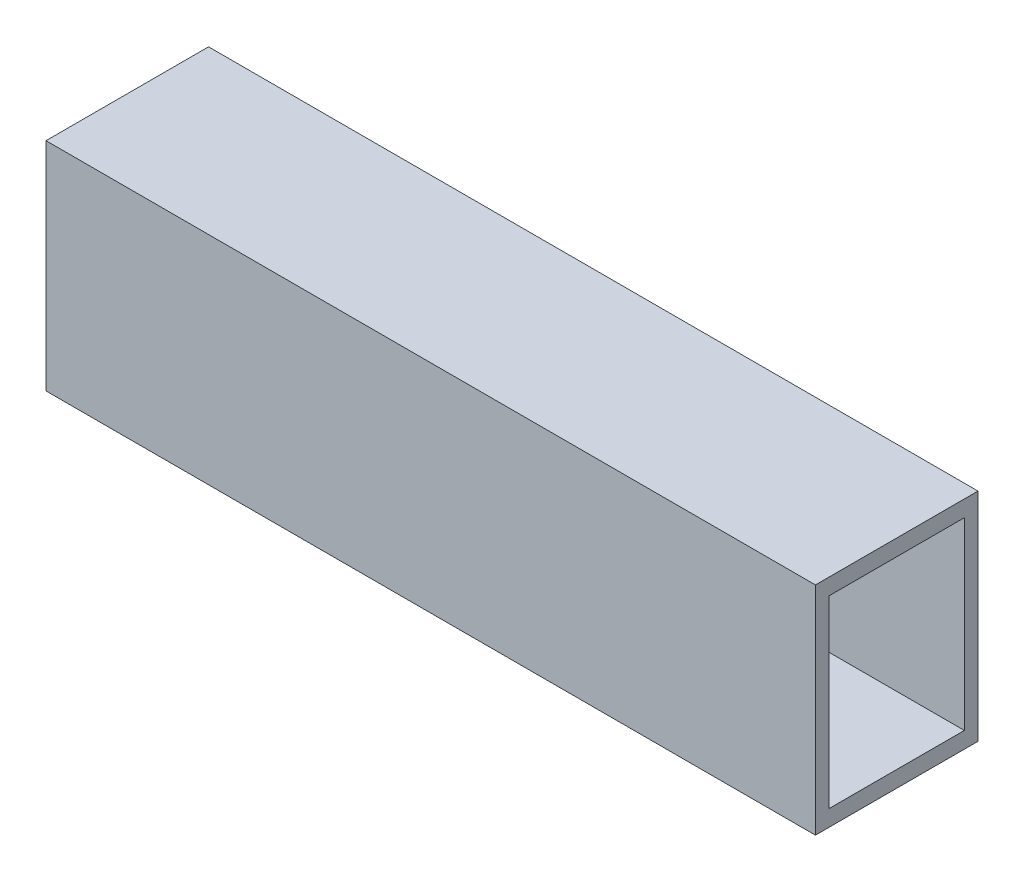
ISO-10303-21;
HEADER;
FILE_DESCRIPTION(('STEP AP214'),'2;1');
FILE_NAME('part.step','',(''),(''),'','','');
FILE_SCHEMA(('AUTOMOTIVE_DESIGN { 1 0 10303 214 1 1 1 1 }'));
ENDSEC;
DATA;
#1=APPLICATION_CONTEXT('core data for automotive mechanical design processes');
#2=APPLICATION_PROTOCOL_DEFINITION('international standard','automotive_design',2000,#1);
#3=PRODUCT_CONTEXT('',#1,'mechanical');
#4=PRODUCT('Part','Part','',(#3));
#5=PRODUCT_RELATED_PRODUCT_CATEGORY('part','',(#4));
#6=PRODUCT_DEFINITION_FORMATION('','',#4);
#7=PRODUCT_DEFINITION_CONTEXT('part definition',#1,'design');
#8=PRODUCT_DEFINITION('design','',#6,#7);
#9=PRODUCT_DEFINITION_SHAPE('','',#8);
#10=(LENGTH_UNIT() NAMED_UNIT(*) SI_UNIT(.MILLI.,.METRE.));
#11=(NAMED_UNIT(*) PLANE_ANGLE_UNIT() SI_UNIT($,.RADIAN.));
#12=(NAMED_UNIT(*) SI_UNIT($,.STERADIAN.) SOLID_ANGLE_UNIT());
#13=UNCERTAINTY_MEASURE_WITH_UNIT(LENGTH_MEASURE(1.E-05),#10,'distance_accuracy_value','');
#14=(GEOMETRIC_REPRESENTATION_CONTEXT(3) GLOBAL_UNCERTAINTY_ASSIGNED_CONTEXT((#13)) GLOBAL_UNIT_ASSIGNED_CONTEXT((#10,
#11,#12)) REPRESENTATION_CONTEXT('',''));
#15=CARTESIAN_POINT('',(0.,0.,0.));
#16=DIRECTION('',(0.,0.,1.));
#17=DIRECTION('',(1.,0.,0.));
#18=AXIS2_PLACEMENT_3D('',#15,#16,#17);
#19=CARTESIAN_POINT('',(142.,0.,0.));
#20=DIRECTION('',(1.,0.,0.));
#21=DIRECTION('',(0.,0.,-1.));
#22=AXIS2_PLACEMENT_3D('',#19,#20,#21);
#23=PLANE('',#22);
#24=DIRECTION('',(0.,0.,-1.));
#25=VECTOR('',#24,1.);
#26=CARTESIAN_POINT('',(142.,-20.,15.));
#27=LINE('',#26,#25);
#28=CARTESIAN_POINT('',(142.,-20.,15.));
#29=VERTEX_POINT('',#28);
#30=CARTESIAN_POINT('',(142.,-20.,-15.));
#31=VERTEX_POINT('',#30);
#32=EDGE_CURVE('E134',#29,#31,#27,.T.);
#33=ORIENTED_EDGE('',*,*,#32,.T.);
#34=DIRECTION('',(0.,1.,0.));
#35=VECTOR('',#34,1.);
#36=CARTESIAN_POINT('',(142.,-20.,-15.));
#37=LINE('',#36,#35);
#38=CARTESIAN_POINT('',(142.,20.,-15.));
#39=VERTEX_POINT('',#38);
#40=EDGE_CURVE('E137',#31,#39,#37,.T.);
#41=ORIENTED_EDGE('',*,*,#40,.T.);
#42=DIRECTION('',(0.,0.,1.));
#43=VECTOR('',#42,1.);
#44=CARTESIAN_POINT('',(142.,20.,15.));
#45=LINE('',#44,#43);
#46=CARTESIAN_POINT('',(142.,20.,15.));
#47=VERTEX_POINT('',#46);
#48=EDGE_CURVE('E140',#39,#47,#45,.T.);
#49=ORIENTED_EDGE('',*,*,#48,.T.);
#50=DIRECTION('',(0.,-1.,0.));
#51=VECTOR('',#50,1.);
#52=CARTESIAN_POINT('',(142.,-20.,15.));
#53=LINE('',#52,#51);
#54=EDGE_CURVE('E142',#47,#29,#53,.T.);
#55=ORIENTED_EDGE('',*,*,#54,.T.);
#56=EDGE_LOOP('',(#33,#41,#49,#55));
#57=FACE_BOUND('',#56,.T.);
#58=DIRECTION('',(0.,1.,0.));
#59=VECTOR('',#58,1.);
#60=CARTESIAN_POINT('',(142.,-17.,-12.4805313389132));
#61=LINE('',#60,#59);
#62=CARTESIAN_POINT('',(142.,-17.,-12.4805313389132));
#63=VERTEX_POINT('',#62);
#64=CARTESIAN_POINT('',(142.,17.,-12.4805313389132));
#65=VERTEX_POINT('',#64);
#66=EDGE_CURVE('E106',#63,#65,#61,.T.);
#67=ORIENTED_EDGE('',*,*,#66,.F.);
#68=DIRECTION('',(0.,0.,-1.));
#69=VECTOR('',#68,1.);
#70=CARTESIAN_POINT('',(142.,-17.,12.4805313389132));
#71=LINE('',#70,#69);
#72=CARTESIAN_POINT('',(142.,-17.,12.4805313389132));
#73=VERTEX_POINT('',#72);
#74=EDGE_CURVE('E98',#73,#63,#71,.T.);
#75=ORIENTED_EDGE('',*,*,#74,.F.);
#76=DIRECTION('',(0.,-1.,0.));
#77=VECTOR('',#76,1.);
#78=CARTESIAN_POINT('',(142.,-17.,12.4805313389132));
#79=LINE('',#78,#77);
#80=CARTESIAN_POINT('',(142.,17.,12.4805313389132));
#81=VERTEX_POINT('',#80);
#82=EDGE_CURVE('E120',#81,#73,#79,.T.);
#83=ORIENTED_EDGE('',*,*,#82,.F.);
#84=DIRECTION('',(0.,0.,1.));
#85=VECTOR('',#84,1.);
#86=CARTESIAN_POINT('',(142.,17.,12.4805313389132));
#87=LINE('',#86,#85);
#88=EDGE_CURVE('E118',#65,#81,#87,.T.);
#89=ORIENTED_EDGE('',*,*,#88,.F.);
#90=EDGE_LOOP('',(#67,#75,#83,#89));
#91=FACE_BOUND('',#90,.T.);
#92=ADVANCED_FACE('F33',(#57,#91),#23,.T.);
#93=CARTESIAN_POINT('',(0.,0.,0.));
#94=DIRECTION('',(1.,0.,0.));
#95=DIRECTION('',(0.,0.,-1.));
#96=AXIS2_PLACEMENT_3D('',#93,#94,#95);
#97=PLANE('',#96);
#98=DIRECTION('',(0.,0.,-1.));
#99=VECTOR('',#98,1.);
#100=CARTESIAN_POINT('',(0.,-20.,15.));
#101=LINE('',#100,#99);
#102=CARTESIAN_POINT('',(0.,-20.,15.));
#103=VERTEX_POINT('',#102);
#104=CARTESIAN_POINT('',(0.,-20.,-15.));
#105=VERTEX_POINT('',#104);
#106=EDGE_CURVE('E114',#103,#105,#101,.T.);
#107=ORIENTED_EDGE('',*,*,#106,.F.);
#108=DIRECTION('',(0.,-1.,0.));
#109=VECTOR('',#108,1.);
#110=CARTESIAN_POINT('',(0.,-20.,15.));
#111=LINE('',#110,#109);
#112=CARTESIAN_POINT('',(0.,20.,15.));
#113=VERTEX_POINT('',#112);
#114=EDGE_CURVE('E138',#113,#103,#111,.T.);
#115=ORIENTED_EDGE('',*,*,#114,.F.);
#116=DIRECTION('',(0.,0.,1.));
#117=VECTOR('',#116,1.);
#118=CARTESIAN_POINT('',(0.,20.,15.));
#119=LINE('',#118,#117);
#120=CARTESIAN_POINT('',(0.,20.,-15.));
#121=VERTEX_POINT('',#120);
#122=EDGE_CURVE('E149',#121,#113,#119,.T.);
#123=ORIENTED_EDGE('',*,*,#122,.F.);
#124=DIRECTION('',(0.,1.,0.));
#125=VECTOR('',#124,1.);
#126=CARTESIAN_POINT('',(0.,-20.,-15.));
#127=LINE('',#126,#125);
#128=EDGE_CURVE('E147',#105,#121,#127,.T.);
#129=ORIENTED_EDGE('',*,*,#128,.F.);
#130=EDGE_LOOP('',(#107,#115,#123,#129));
#131=FACE_BOUND('',#130,.T.);
#132=DIRECTION('',(0.,0.,-1.));
#133=VECTOR('',#132,1.);
#134=CARTESIAN_POINT('',(0.,-17.,12.4805313389132));
#135=LINE('',#134,#133);
#136=CARTESIAN_POINT('',(0.,-17.,12.4805313389132));
#137=VERTEX_POINT('',#136);
#138=CARTESIAN_POINT('',(0.,-17.,-12.4805313389132));
#139=VERTEX_POINT('',#138);
#140=EDGE_CURVE('E56',#137,#139,#135,.T.);
#141=ORIENTED_EDGE('',*,*,#140,.T.);
#142=DIRECTION('',(0.,1.,0.));
#143=VECTOR('',#142,1.);
#144=CARTESIAN_POINT('',(0.,-17.,-12.4805313389132));
#145=LINE('',#144,#143);
#146=CARTESIAN_POINT('',(0.,17.,-12.4805313389132));
#147=VERTEX_POINT('',#146);
#148=EDGE_CURVE('E113',#139,#147,#145,.T.);
#149=ORIENTED_EDGE('',*,*,#148,.T.);
#150=DIRECTION('',(0.,0.,1.));
#151=VECTOR('',#150,1.);
#152=CARTESIAN_POINT('',(0.,17.,12.4805313389132));
#153=LINE('',#152,#151);
#154=CARTESIAN_POINT('',(0.,17.,12.4805313389132));
#155=VERTEX_POINT('',#154);
#156=EDGE_CURVE('E126',#147,#155,#153,.T.);
#157=ORIENTED_EDGE('',*,*,#156,.T.);
#158=DIRECTION('',(0.,-1.,0.));
#159=VECTOR('',#158,1.);
#160=CARTESIAN_POINT('',(0.,-17.,12.4805313389132));
#161=LINE('',#160,#159);
#162=EDGE_CURVE('E107',#155,#137,#161,.T.);
#163=ORIENTED_EDGE('',*,*,#162,.T.);
#164=EDGE_LOOP('',(#141,#149,#157,#163));
#165=FACE_BOUND('',#164,.T.);
#166=ADVANCED_FACE('F167',(#131,#165),#97,.F.);
#167=CARTESIAN_POINT('',(142.,-20.,15.));
#168=DIRECTION('',(0.,1.,0.));
#169=DIRECTION('',(0.,0.,1.));
#170=AXIS2_PLACEMENT_3D('',#167,#168,#169);
#171=PLANE('',#170);
#172=ORIENTED_EDGE('',*,*,#106,.T.);
#173=DIRECTION('',(-1.,0.,0.));
#174=VECTOR('',#173,1.);
#175=CARTESIAN_POINT('',(142.,-20.,-15.));
#176=LINE('',#175,#174);
#177=EDGE_CURVE('E11',#31,#105,#176,.T.);
#178=ORIENTED_EDGE('',*,*,#177,.F.);
#179=ORIENTED_EDGE('',*,*,#32,.F.);
#180=DIRECTION('',(-1.,0.,0.));
#181=VECTOR('',#180,1.);
#182=CARTESIAN_POINT('',(142.,-20.,15.));
#183=LINE('',#182,#181);
#184=EDGE_CURVE('E144',#29,#103,#183,.T.);
#185=ORIENTED_EDGE('',*,*,#184,.T.);
#186=EDGE_LOOP('',(#172,#178,#179,#185));
#187=FACE_BOUND('',#186,.T.);
#188=ADVANCED_FACE('F35',(#187),#171,.F.);
#189=CARTESIAN_POINT('',(142.,-20.,-15.));
#190=DIRECTION('',(0.,0.,1.));
#191=DIRECTION('',(1.,0.,0.));
#192=AXIS2_PLACEMENT_3D('',#189,#190,#191);
#193=PLANE('',#192);
#194=ORIENTED_EDGE('',*,*,#128,.T.);
#195=DIRECTION('',(-1.,0.,0.));
#196=VECTOR('',#195,1.);
#197=CARTESIAN_POINT('',(142.,20.,-15.));
#198=LINE('',#197,#196);
#199=EDGE_CURVE('E41',#39,#121,#198,.T.);
#200=ORIENTED_EDGE('',*,*,#199,.F.);
#201=ORIENTED_EDGE('',*,*,#40,.F.);
#202=ORIENTED_EDGE('',*,*,#177,.T.);
#203=EDGE_LOOP('',(#194,#200,#201,#202));
#204=FACE_BOUND('',#203,.T.);
#205=ADVANCED_FACE('F177',(#204),#193,.F.);
#206=CARTESIAN_POINT('',(142.,20.,15.));
#207=DIRECTION('',(0.,-1.,0.));
#208=DIRECTION('',(0.,0.,-1.));
#209=AXIS2_PLACEMENT_3D('',#206,#207,#208);
#210=PLANE('',#209);
#211=ORIENTED_EDGE('',*,*,#122,.T.);
#212=DIRECTION('',(-1.,0.,0.));
#213=VECTOR('',#212,1.);
#214=CARTESIAN_POINT('',(142.,20.,15.));
#215=LINE('',#214,#213);
#216=EDGE_CURVE('E154',#47,#113,#215,.T.);
#217=ORIENTED_EDGE('',*,*,#216,.F.);
#218=ORIENTED_EDGE('',*,*,#48,.F.);
#219=ORIENTED_EDGE('',*,*,#199,.T.);
#220=EDGE_LOOP('',(#211,#217,#218,#219));
#221=FACE_BOUND('',#220,.T.);
#222=ADVANCED_FACE('F161',(#221),#210,.F.);
#223=CARTESIAN_POINT('',(142.,-20.,15.));
#224=DIRECTION('',(0.,0.,-1.));
#225=DIRECTION('',(-1.,0.,0.));
#226=AXIS2_PLACEMENT_3D('',#223,#224,#225);
#227=PLANE('',#226);
#228=ORIENTED_EDGE('',*,*,#114,.T.);
#229=ORIENTED_EDGE('',*,*,#184,.F.);
#230=ORIENTED_EDGE('',*,*,#54,.F.);
#231=ORIENTED_EDGE('',*,*,#216,.T.);
#232=EDGE_LOOP('',(#228,#229,#230,#231));
#233=FACE_BOUND('',#232,.T.);
#234=ADVANCED_FACE('F171',(#233),#227,.F.);
#235=CARTESIAN_POINT('',(142.,-17.,12.4805313389132));
#236=DIRECTION('',(0.,1.,0.));
#237=DIRECTION('',(0.,0.,1.));
#238=AXIS2_PLACEMENT_3D('',#235,#236,#237);
#239=PLANE('',#238);
#240=ORIENTED_EDGE('',*,*,#140,.F.);
#241=DIRECTION('',(-1.,0.,0.));
#242=VECTOR('',#241,1.);
#243=CARTESIAN_POINT('',(142.,-17.,12.4805313389132));
#244=LINE('',#243,#242);
#245=EDGE_CURVE('E102',#73,#137,#244,.T.);
#246=ORIENTED_EDGE('',*,*,#245,.F.);
#247=ORIENTED_EDGE('',*,*,#74,.T.);
#248=DIRECTION('',(-1.,0.,0.));
#249=VECTOR('',#248,1.);
#250=CARTESIAN_POINT('',(142.,-17.,-12.4805313389132));
#251=LINE('',#250,#249);
#252=EDGE_CURVE('E101',#63,#139,#251,.T.);
#253=ORIENTED_EDGE('',*,*,#252,.T.);
#254=EDGE_LOOP('',(#240,#246,#247,#253));
#255=FACE_BOUND('',#254,.T.);
#256=ADVANCED_FACE('F100',(#255),#239,.T.);
#257=CARTESIAN_POINT('',(142.,-17.,-12.4805313389132));
#258=DIRECTION('',(0.,0.,1.));
#259=DIRECTION('',(1.,0.,0.));
#260=AXIS2_PLACEMENT_3D('',#257,#258,#259);
#261=PLANE('',#260);
#262=ORIENTED_EDGE('',*,*,#148,.F.);
#263=ORIENTED_EDGE('',*,*,#252,.F.);
#264=ORIENTED_EDGE('',*,*,#66,.T.);
#265=DIRECTION('',(-1.,0.,0.));
#266=VECTOR('',#265,1.);
#267=CARTESIAN_POINT('',(142.,17.,-12.4805313389132));
#268=LINE('',#267,#266);
#269=EDGE_CURVE('E115',#65,#147,#268,.T.);
#270=ORIENTED_EDGE('',*,*,#269,.T.);
#271=EDGE_LOOP('',(#262,#263,#264,#270));
#272=FACE_BOUND('',#271,.T.);
#273=ADVANCED_FACE('F110',(#272),#261,.T.);
#274=CARTESIAN_POINT('',(142.,17.,12.4805313389132));
#275=DIRECTION('',(0.,-1.,0.));
#276=DIRECTION('',(0.,0.,-1.));
#277=AXIS2_PLACEMENT_3D('',#274,#275,#276);
#278=PLANE('',#277);
#279=ORIENTED_EDGE('',*,*,#156,.F.);
#280=ORIENTED_EDGE('',*,*,#269,.F.);
#281=ORIENTED_EDGE('',*,*,#88,.T.);
#282=DIRECTION('',(-1.,0.,0.));
#283=VECTOR('',#282,1.);
#284=CARTESIAN_POINT('',(142.,17.,12.4805313389132));
#285=LINE('',#284,#283);
#286=EDGE_CURVE('E48',#81,#155,#285,.T.);
#287=ORIENTED_EDGE('',*,*,#286,.T.);
#288=EDGE_LOOP('',(#279,#280,#281,#287));
#289=FACE_BOUND('',#288,.T.);
#290=ADVANCED_FACE('F200',(#289),#278,.T.);
#291=CARTESIAN_POINT('',(142.,-17.,12.4805313389132));
#292=DIRECTION('',(0.,0.,-1.));
#293=DIRECTION('',(-1.,0.,0.));
#294=AXIS2_PLACEMENT_3D('',#291,#292,#293);
#295=PLANE('',#294);
#296=ORIENTED_EDGE('',*,*,#162,.F.);
#297=ORIENTED_EDGE('',*,*,#286,.F.);
#298=ORIENTED_EDGE('',*,*,#82,.T.);
#299=ORIENTED_EDGE('',*,*,#245,.T.);
#300=EDGE_LOOP('',(#296,#297,#298,#299));
#301=FACE_BOUND('',#300,.T.);
#302=ADVANCED_FACE('F204',(#301),#295,.T.);
#303=CLOSED_SHELL('',(#92,#166,#188,#205,#222,#234,#256,#273,#290,#302));
#304=MANIFOLD_SOLID_BREP('B2',#303);
#305=ADVANCED_BREP_SHAPE_REPRESENTATION('',(#18,#304),#14);
#306=SHAPE_DEFINITION_REPRESENTATION(#9,#305);
ENDSEC;
END-ISO-10303-21;
